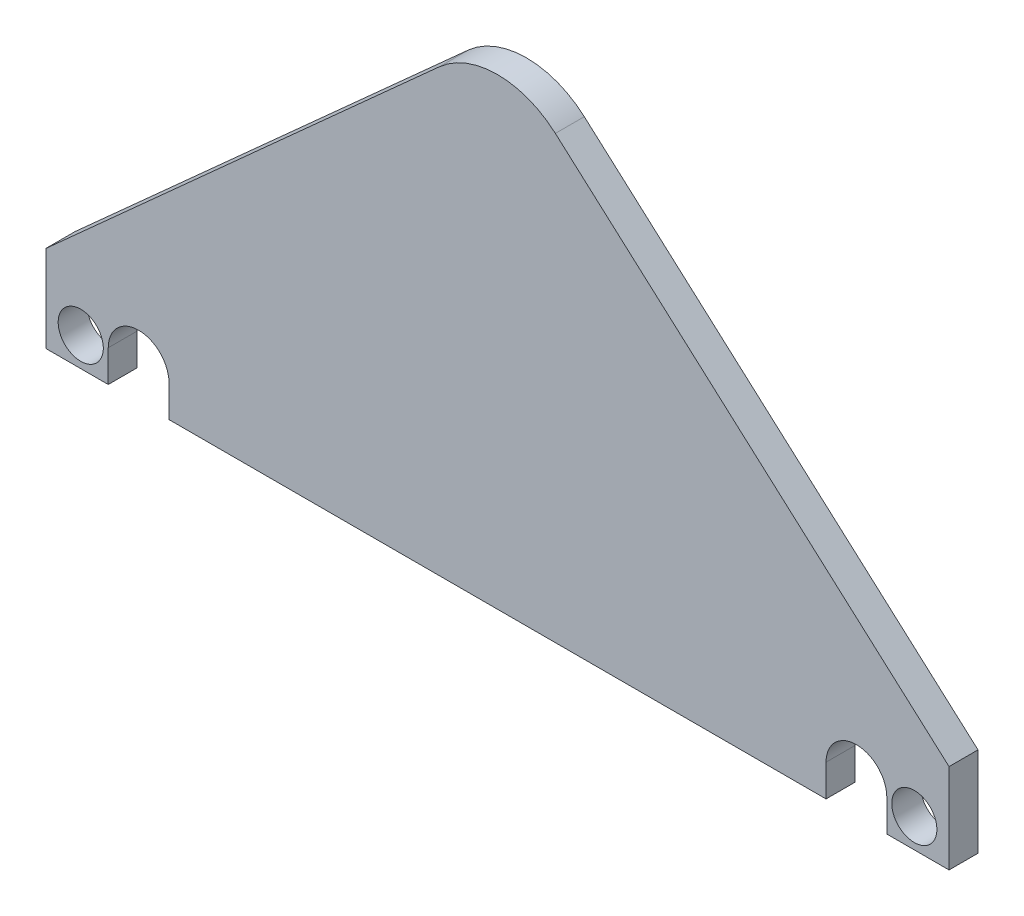
ISO-10303-21;
HEADER;
FILE_DESCRIPTION(('STEP AP214'),'2;1');
FILE_NAME('part.step','',(''),(''),'','','');
FILE_SCHEMA(('AUTOMOTIVE_DESIGN { 1 0 10303 214 1 1 1 1 }'));
ENDSEC;
DATA;
#1=APPLICATION_CONTEXT('core data for automotive mechanical design processes');
#2=APPLICATION_PROTOCOL_DEFINITION('international standard','automotive_design',2000,#1);
#3=PRODUCT_CONTEXT('',#1,'mechanical');
#4=PRODUCT('Part','Part','',(#3));
#5=PRODUCT_RELATED_PRODUCT_CATEGORY('part','',(#4));
#6=PRODUCT_DEFINITION_FORMATION('','',#4);
#7=PRODUCT_DEFINITION_CONTEXT('part definition',#1,'design');
#8=PRODUCT_DEFINITION('design','',#6,#7);
#9=PRODUCT_DEFINITION_SHAPE('','',#8);
#10=(LENGTH_UNIT() NAMED_UNIT(*) SI_UNIT(.MILLI.,.METRE.));
#11=(NAMED_UNIT(*) PLANE_ANGLE_UNIT() SI_UNIT($,.RADIAN.));
#12=(NAMED_UNIT(*) SI_UNIT($,.STERADIAN.) SOLID_ANGLE_UNIT());
#13=UNCERTAINTY_MEASURE_WITH_UNIT(LENGTH_MEASURE(1.E-05),#10,'distance_accuracy_value','');
#14=(GEOMETRIC_REPRESENTATION_CONTEXT(3) GLOBAL_UNCERTAINTY_ASSIGNED_CONTEXT((#13)) GLOBAL_UNIT_ASSIGNED_CONTEXT((#10,
#11,#12)) REPRESENTATION_CONTEXT('',''));
#15=CARTESIAN_POINT('',(0.,0.,0.));
#16=DIRECTION('',(0.,0.,1.));
#17=DIRECTION('',(1.,0.,0.));
#18=AXIS2_PLACEMENT_3D('',#15,#16,#17);
#19=CARTESIAN_POINT('',(0.,82.5,-1130.87615991083));
#20=DIRECTION('',(0.,0.,-1.));
#21=DIRECTION('',(-1.,0.,0.));
#22=AXIS2_PLACEMENT_3D('',#19,#20,#21);
#23=PLANE('',#22);
#24=CARTESIAN_POINT('',(-72.,22.5,-1130.87615991083));
#25=DIRECTION('',(0.,0.,-1.));
#26=DIRECTION('',(-1.,0.,0.));
#27=AXIS2_PLACEMENT_3D('',#24,#25,#26);
#28=CIRCLE('',#27,3.9);
#29=CARTESIAN_POINT('',(-75.9,22.5,-1130.87615991083));
#30=VERTEX_POINT('',#29);
#31=EDGE_CURVE('E170',#30,#30,#28,.T.);
#32=ORIENTED_EDGE('',*,*,#31,.F.);
#33=EDGE_LOOP('',(#32));
#34=FACE_BOUND('',#33,.T.);
#35=DIRECTION('',(-1.,0.,0.));
#36=VECTOR('',#35,1.);
#37=CARTESIAN_POINT('',(-67.25,17.5,-1130.87615991083));
#38=LINE('',#37,#36);
#39=CARTESIAN_POINT('',(-67.25,17.5,-1130.87615991083));
#40=VERTEX_POINT('',#39);
#41=CARTESIAN_POINT('',(-78.,17.5,-1130.87615991083));
#42=VERTEX_POINT('',#41);
#43=EDGE_CURVE('E193',#40,#42,#38,.T.);
#44=ORIENTED_EDGE('',*,*,#43,.T.);
#45=DIRECTION('',(0.,1.,0.));
#46=VECTOR('',#45,1.);
#47=CARTESIAN_POINT('',(-78.,17.5,-1130.87615991083));
#48=LINE('',#47,#46);
#49=CARTESIAN_POINT('',(-78.,32.5,-1130.87615991083));
#50=VERTEX_POINT('',#49);
#51=EDGE_CURVE('E111',#42,#50,#48,.T.);
#52=ORIENTED_EDGE('',*,*,#51,.T.);
#53=DIRECTION('',(0.743400538534937,0.668846499060857,0.));
#54=VECTOR('',#53,1.);
#55=CARTESIAN_POINT('',(-78.,32.5,-1130.87615991083));
#56=LINE('',#55,#54);
#57=CARTESIAN_POINT('',(-10.0326974859129,93.651008078024,-1130.87615991083));
#58=VERTEX_POINT('',#57);
#59=EDGE_CURVE('E226',#50,#58,#56,.T.);
#60=ORIENTED_EDGE('',*,*,#59,.T.);
#61=CARTESIAN_POINT('',(0.,82.5,-1130.87615991083));
#62=DIRECTION('',(0.,0.,-1.));
#63=DIRECTION('',(-1.,0.,0.));
#64=AXIS2_PLACEMENT_3D('',#61,#62,#63);
#65=CIRCLE('',#64,15.);
#66=CARTESIAN_POINT('',(9.98992011578784,93.689347437638,-1130.87615991083));
#67=VERTEX_POINT('',#66);
#68=EDGE_CURVE('E245',#58,#67,#65,.T.);
#69=ORIENTED_EDGE('',*,*,#68,.T.);
#70=DIRECTION('',(0.745956495842538,-0.665994674385856,0.));
#71=VECTOR('',#70,1.);
#72=CARTESIAN_POINT('',(78.,32.9695182520457,-1130.87615991083));
#73=LINE('',#72,#71);
#74=CARTESIAN_POINT('',(78.,32.9695182520457,-1130.87615991083));
#75=VERTEX_POINT('',#74);
#76=EDGE_CURVE('E242',#67,#75,#73,.T.);
#77=ORIENTED_EDGE('',*,*,#76,.T.);
#78=DIRECTION('',(0.,-1.,0.));
#79=VECTOR('',#78,1.);
#80=CARTESIAN_POINT('',(78.,17.5,-1130.87615991083));
#81=LINE('',#80,#79);
#82=CARTESIAN_POINT('',(78.,17.5,-1130.87615991083));
#83=VERTEX_POINT('',#82);
#84=EDGE_CURVE('E244',#75,#83,#81,.T.);
#85=ORIENTED_EDGE('',*,*,#84,.T.);
#86=DIRECTION('',(-1.,0.,0.));
#87=VECTOR('',#86,1.);
#88=CARTESIAN_POINT('',(78.,17.5,-1130.87615991083));
#89=LINE('',#88,#87);
#90=CARTESIAN_POINT('',(67.25,17.5,-1130.87615991083));
#91=VERTEX_POINT('',#90);
#92=EDGE_CURVE('E247',#83,#91,#89,.T.);
#93=ORIENTED_EDGE('',*,*,#92,.T.);
#94=DIRECTION('',(0.,1.,0.));
#95=VECTOR('',#94,1.);
#96=CARTESIAN_POINT('',(67.25,17.5,-1130.87615991083));
#97=LINE('',#96,#95);
#98=CARTESIAN_POINT('',(67.25,23.,-1130.87615991083));
#99=VERTEX_POINT('',#98);
#100=EDGE_CURVE('E253',#91,#99,#97,.T.);
#101=ORIENTED_EDGE('',*,*,#100,.T.);
#102=CARTESIAN_POINT('',(62.,23.,-1130.87615991083));
#103=DIRECTION('',(0.,0.,1.));
#104=DIRECTION('',(1.,0.,0.));
#105=AXIS2_PLACEMENT_3D('',#102,#103,#104);
#106=CIRCLE('',#105,5.25);
#107=CARTESIAN_POINT('',(56.75,23.,-1130.87615991083));
#108=VERTEX_POINT('',#107);
#109=EDGE_CURVE('E255',#99,#108,#106,.T.);
#110=ORIENTED_EDGE('',*,*,#109,.T.);
#111=DIRECTION('',(0.,-1.,0.));
#112=VECTOR('',#111,1.);
#113=CARTESIAN_POINT('',(56.75,23.,-1130.87615991083));
#114=LINE('',#113,#112);
#115=CARTESIAN_POINT('',(56.75,17.5,-1130.87615991083));
#116=VERTEX_POINT('',#115);
#117=EDGE_CURVE('E257',#108,#116,#114,.T.);
#118=ORIENTED_EDGE('',*,*,#117,.T.);
#119=DIRECTION('',(-1.,0.,0.));
#120=VECTOR('',#119,1.);
#121=CARTESIAN_POINT('',(56.75,17.5,-1130.87615991083));
#122=LINE('',#121,#120);
#123=CARTESIAN_POINT('',(-56.75,17.5,-1130.87615991083));
#124=VERTEX_POINT('',#123);
#125=EDGE_CURVE('E148',#116,#124,#122,.T.);
#126=ORIENTED_EDGE('',*,*,#125,.T.);
#127=DIRECTION('',(0.,1.,0.));
#128=VECTOR('',#127,1.);
#129=CARTESIAN_POINT('',(-56.75,23.,-1130.87615991083));
#130=LINE('',#129,#128);
#131=CARTESIAN_POINT('',(-56.75,23.,-1130.87615991083));
#132=VERTEX_POINT('',#131);
#133=EDGE_CURVE('E142',#124,#132,#130,.T.);
#134=ORIENTED_EDGE('',*,*,#133,.T.);
#135=CARTESIAN_POINT('',(-62.,23.,-1130.87615991083));
#136=DIRECTION('',(0.,0.,1.));
#137=DIRECTION('',(-1.,0.,0.));
#138=AXIS2_PLACEMENT_3D('',#135,#136,#137);
#139=CIRCLE('',#138,5.25);
#140=CARTESIAN_POINT('',(-67.25,23.,-1130.87615991083));
#141=VERTEX_POINT('',#140);
#142=EDGE_CURVE('E146',#132,#141,#139,.T.);
#143=ORIENTED_EDGE('',*,*,#142,.T.);
#144=DIRECTION('',(0.,-1.,0.));
#145=VECTOR('',#144,1.);
#146=CARTESIAN_POINT('',(-67.25,17.5,-1130.87615991083));
#147=LINE('',#146,#145);
#148=EDGE_CURVE('E50',#141,#40,#147,.T.);
#149=ORIENTED_EDGE('',*,*,#148,.T.);
#150=EDGE_LOOP('',(#44,#52,#60,#69,#77,#85,#93,#101,#110,#118,#126,#134,#143,#149));
#151=FACE_BOUND('',#150,.T.);
#152=CARTESIAN_POINT('',(72.,22.5,-1130.87615991083));
#153=DIRECTION('',(0.,0.,-1.));
#154=DIRECTION('',(-1.,0.,0.));
#155=AXIS2_PLACEMENT_3D('',#152,#153,#154);
#156=CIRCLE('',#155,3.9);
#157=CARTESIAN_POINT('',(68.1,22.5,-1130.87615991083));
#158=VERTEX_POINT('',#157);
#159=EDGE_CURVE('E299',#158,#158,#156,.T.);
#160=ORIENTED_EDGE('',*,*,#159,.F.);
#161=EDGE_LOOP('',(#160));
#162=FACE_BOUND('',#161,.T.);
#163=ADVANCED_FACE('F33',(#34,#151,#162),#23,.T.);
#164=CARTESIAN_POINT('',(0.,82.5,-1125.87615991083));
#165=DIRECTION('',(0.,0.,-1.));
#166=DIRECTION('',(-1.,0.,0.));
#167=AXIS2_PLACEMENT_3D('',#164,#165,#166);
#168=PLANE('',#167);
#169=DIRECTION('',(-1.,0.,0.));
#170=VECTOR('',#169,1.);
#171=CARTESIAN_POINT('',(-67.25,17.5,-1125.87615991083));
#172=LINE('',#171,#170);
#173=CARTESIAN_POINT('',(-67.25,17.5,-1125.87615991083));
#174=VERTEX_POINT('',#173);
#175=CARTESIAN_POINT('',(-78.,17.5,-1125.87615991083));
#176=VERTEX_POINT('',#175);
#177=EDGE_CURVE('E166',#174,#176,#172,.T.);
#178=ORIENTED_EDGE('',*,*,#177,.F.);
#179=DIRECTION('',(0.,-1.,0.));
#180=VECTOR('',#179,1.);
#181=CARTESIAN_POINT('',(-67.25,17.5,-1125.87615991083));
#182=LINE('',#181,#180);
#183=CARTESIAN_POINT('',(-67.25,23.,-1125.87615991083));
#184=VERTEX_POINT('',#183);
#185=EDGE_CURVE('E103',#184,#174,#182,.T.);
#186=ORIENTED_EDGE('',*,*,#185,.F.);
#187=CARTESIAN_POINT('',(-62.,23.,-1125.87615991083));
#188=DIRECTION('',(0.,0.,1.));
#189=DIRECTION('',(-1.,0.,0.));
#190=AXIS2_PLACEMENT_3D('',#187,#188,#189);
#191=CIRCLE('',#190,5.25);
#192=CARTESIAN_POINT('',(-56.75,23.,-1125.87615991083));
#193=VERTEX_POINT('',#192);
#194=EDGE_CURVE('E97',#193,#184,#191,.T.);
#195=ORIENTED_EDGE('',*,*,#194,.F.);
#196=DIRECTION('',(0.,1.,0.));
#197=VECTOR('',#196,1.);
#198=CARTESIAN_POINT('',(-56.75,23.,-1125.87615991083));
#199=LINE('',#198,#197);
#200=CARTESIAN_POINT('',(-56.75,17.5,-1125.87615991083));
#201=VERTEX_POINT('',#200);
#202=EDGE_CURVE('E156',#201,#193,#199,.T.);
#203=ORIENTED_EDGE('',*,*,#202,.F.);
#204=DIRECTION('',(-1.,0.,0.));
#205=VECTOR('',#204,1.);
#206=CARTESIAN_POINT('',(56.75,17.5,-1125.87615991083));
#207=LINE('',#206,#205);
#208=CARTESIAN_POINT('',(56.75,17.5,-1125.87615991083));
#209=VERTEX_POINT('',#208);
#210=EDGE_CURVE('E188',#209,#201,#207,.T.);
#211=ORIENTED_EDGE('',*,*,#210,.F.);
#212=DIRECTION('',(0.,-1.,0.));
#213=VECTOR('',#212,1.);
#214=CARTESIAN_POINT('',(56.75,23.,-1125.87615991083));
#215=LINE('',#214,#213);
#216=CARTESIAN_POINT('',(56.75,23.,-1125.87615991083));
#217=VERTEX_POINT('',#216);
#218=EDGE_CURVE('E186',#217,#209,#215,.T.);
#219=ORIENTED_EDGE('',*,*,#218,.F.);
#220=CARTESIAN_POINT('',(62.,23.,-1125.87615991083));
#221=DIRECTION('',(0.,0.,1.));
#222=DIRECTION('',(1.,0.,0.));
#223=AXIS2_PLACEMENT_3D('',#220,#221,#222);
#224=CIRCLE('',#223,5.25);
#225=CARTESIAN_POINT('',(67.25,23.,-1125.87615991083));
#226=VERTEX_POINT('',#225);
#227=EDGE_CURVE('E184',#226,#217,#224,.T.);
#228=ORIENTED_EDGE('',*,*,#227,.F.);
#229=DIRECTION('',(0.,1.,0.));
#230=VECTOR('',#229,1.);
#231=CARTESIAN_POINT('',(67.25,17.5,-1125.87615991083));
#232=LINE('',#231,#230);
#233=CARTESIAN_POINT('',(67.25,17.5,-1125.87615991083));
#234=VERTEX_POINT('',#233);
#235=EDGE_CURVE('E182',#234,#226,#232,.T.);
#236=ORIENTED_EDGE('',*,*,#235,.F.);
#237=DIRECTION('',(-1.,0.,0.));
#238=VECTOR('',#237,1.);
#239=CARTESIAN_POINT('',(78.,17.5,-1125.87615991083));
#240=LINE('',#239,#238);
#241=CARTESIAN_POINT('',(78.,17.5,-1125.87615991083));
#242=VERTEX_POINT('',#241);
#243=EDGE_CURVE('E180',#242,#234,#240,.T.);
#244=ORIENTED_EDGE('',*,*,#243,.F.);
#245=DIRECTION('',(0.,-1.,0.));
#246=VECTOR('',#245,1.);
#247=CARTESIAN_POINT('',(78.,17.5,-1125.87615991083));
#248=LINE('',#247,#246);
#249=CARTESIAN_POINT('',(78.,32.9695182520457,-1125.87615991083));
#250=VERTEX_POINT('',#249);
#251=EDGE_CURVE('E178',#250,#242,#248,.T.);
#252=ORIENTED_EDGE('',*,*,#251,.F.);
#253=DIRECTION('',(0.745956495842538,-0.665994674385856,0.));
#254=VECTOR('',#253,1.);
#255=CARTESIAN_POINT('',(78.,32.9695182520457,-1125.87615991083));
#256=LINE('',#255,#254);
#257=CARTESIAN_POINT('',(9.98992011578784,93.689347437638,-1125.87615991083));
#258=VERTEX_POINT('',#257);
#259=EDGE_CURVE('E176',#258,#250,#256,.T.);
#260=ORIENTED_EDGE('',*,*,#259,.F.);
#261=CARTESIAN_POINT('',(0.,82.5,-1125.87615991083));
#262=DIRECTION('',(0.,0.,-1.));
#263=DIRECTION('',(-1.,0.,0.));
#264=AXIS2_PLACEMENT_3D('',#261,#262,#263);
#265=CIRCLE('',#264,15.);
#266=CARTESIAN_POINT('',(-10.0326974859129,93.651008078024,-1125.87615991083));
#267=VERTEX_POINT('',#266);
#268=EDGE_CURVE('E174',#267,#258,#265,.T.);
#269=ORIENTED_EDGE('',*,*,#268,.F.);
#270=DIRECTION('',(0.743400538534937,0.668846499060857,0.));
#271=VECTOR('',#270,1.);
#272=CARTESIAN_POINT('',(-78.,32.5,-1125.87615991083));
#273=LINE('',#272,#271);
#274=CARTESIAN_POINT('',(-78.,32.5,-1125.87615991083));
#275=VERTEX_POINT('',#274);
#276=EDGE_CURVE('E172',#275,#267,#273,.T.);
#277=ORIENTED_EDGE('',*,*,#276,.F.);
#278=DIRECTION('',(0.,1.,0.));
#279=VECTOR('',#278,1.);
#280=CARTESIAN_POINT('',(-78.,17.5,-1125.87615991083));
#281=LINE('',#280,#279);
#282=EDGE_CURVE('E169',#176,#275,#281,.T.);
#283=ORIENTED_EDGE('',*,*,#282,.F.);
#284=EDGE_LOOP('',(#178,#186,#195,#203,#211,#219,#228,#236,#244,#252,#260,#269,#277,#283));
#285=FACE_BOUND('',#284,.T.);
#286=CARTESIAN_POINT('',(-72.,22.5,-1125.87615991083));
#287=DIRECTION('',(0.,0.,-1.));
#288=DIRECTION('',(-1.,0.,0.));
#289=AXIS2_PLACEMENT_3D('',#286,#287,#288);
#290=CIRCLE('',#289,3.9);
#291=CARTESIAN_POINT('',(-75.9,22.5,-1125.87615991083));
#292=VERTEX_POINT('',#291);
#293=EDGE_CURVE('E305',#292,#292,#290,.T.);
#294=ORIENTED_EDGE('',*,*,#293,.T.);
#295=EDGE_LOOP('',(#294));
#296=FACE_BOUND('',#295,.T.);
#297=CARTESIAN_POINT('',(72.,22.5,-1125.87615991083));
#298=DIRECTION('',(0.,0.,-1.));
#299=DIRECTION('',(-1.,0.,0.));
#300=AXIS2_PLACEMENT_3D('',#297,#298,#299);
#301=CIRCLE('',#300,3.9);
#302=CARTESIAN_POINT('',(68.1,22.5,-1125.87615991083));
#303=VERTEX_POINT('',#302);
#304=EDGE_CURVE('E302',#303,#303,#301,.T.);
#305=ORIENTED_EDGE('',*,*,#304,.T.);
#306=EDGE_LOOP('',(#305));
#307=FACE_BOUND('',#306,.T.);
#308=ADVANCED_FACE('F230',(#285,#296,#307),#168,.F.);
#309=CARTESIAN_POINT('',(-67.25,17.5,-1130.87615991083));
#310=DIRECTION('',(0.,1.,0.));
#311=DIRECTION('',(0.,0.,1.));
#312=AXIS2_PLACEMENT_3D('',#309,#310,#311);
#313=PLANE('',#312);
#314=ORIENTED_EDGE('',*,*,#177,.T.);
#315=DIRECTION('',(0.,0.,1.));
#316=VECTOR('',#315,1.);
#317=CARTESIAN_POINT('',(-78.,17.5,-1130.87615991083));
#318=LINE('',#317,#316);
#319=EDGE_CURVE('E11',#42,#176,#318,.T.);
#320=ORIENTED_EDGE('',*,*,#319,.F.);
#321=ORIENTED_EDGE('',*,*,#43,.F.);
#322=DIRECTION('',(0.,0.,1.));
#323=VECTOR('',#322,1.);
#324=CARTESIAN_POINT('',(-67.25,17.5,-1130.87615991083));
#325=LINE('',#324,#323);
#326=EDGE_CURVE('E162',#40,#174,#325,.T.);
#327=ORIENTED_EDGE('',*,*,#326,.T.);
#328=EDGE_LOOP('',(#314,#320,#321,#327));
#329=FACE_BOUND('',#328,.T.);
#330=ADVANCED_FACE('F35',(#329),#313,.F.);
#331=CARTESIAN_POINT('',(-78.,17.5,-1130.87615991083));
#332=DIRECTION('',(1.,0.,0.));
#333=DIRECTION('',(0.,0.,-1.));
#334=AXIS2_PLACEMENT_3D('',#331,#332,#333);
#335=PLANE('',#334);
#336=ORIENTED_EDGE('',*,*,#282,.T.);
#337=DIRECTION('',(0.,0.,1.));
#338=VECTOR('',#337,1.);
#339=CARTESIAN_POINT('',(-78.,32.5,-1130.87615991083));
#340=LINE('',#339,#338);
#341=EDGE_CURVE('E42',#50,#275,#340,.T.);
#342=ORIENTED_EDGE('',*,*,#341,.F.);
#343=ORIENTED_EDGE('',*,*,#51,.F.);
#344=ORIENTED_EDGE('',*,*,#319,.T.);
#345=EDGE_LOOP('',(#336,#342,#343,#344));
#346=FACE_BOUND('',#345,.T.);
#347=ADVANCED_FACE('F418',(#346),#335,.F.);
#348=CARTESIAN_POINT('',(-78.,32.5,-1130.87615991083));
#349=DIRECTION('',(0.668846499060857,-0.743400538534937,0.));
#350=DIRECTION('',(0.743400538534937,0.668846499060857,0.));
#351=AXIS2_PLACEMENT_3D('',#348,#349,#350);
#352=PLANE('',#351);
#353=ORIENTED_EDGE('',*,*,#276,.T.);
#354=DIRECTION('',(0.,0.,1.));
#355=VECTOR('',#354,1.);
#356=CARTESIAN_POINT('',(-10.0326974859129,93.651008078024,-1130.87615991083));
#357=LINE('',#356,#355);
#358=EDGE_CURVE('E218',#58,#267,#357,.T.);
#359=ORIENTED_EDGE('',*,*,#358,.F.);
#360=ORIENTED_EDGE('',*,*,#59,.F.);
#361=ORIENTED_EDGE('',*,*,#341,.T.);
#362=EDGE_LOOP('',(#353,#359,#360,#361));
#363=FACE_BOUND('',#362,.T.);
#364=ADVANCED_FACE('F224',(#363),#352,.F.);
#365=CARTESIAN_POINT('',(0.,82.5,-1130.87615991083));
#366=DIRECTION('',(0.,0.,1.));
#367=DIRECTION('',(1.,0.,0.));
#368=AXIS2_PLACEMENT_3D('',#365,#366,#367);
#369=CYLINDRICAL_SURFACE('',#368,15.);
#370=ORIENTED_EDGE('',*,*,#268,.T.);
#371=DIRECTION('',(0.,0.,1.));
#372=VECTOR('',#371,1.);
#373=CARTESIAN_POINT('',(9.98992011578784,93.689347437638,-1130.87615991083));
#374=LINE('',#373,#372);
#375=EDGE_CURVE('E215',#67,#258,#374,.T.);
#376=ORIENTED_EDGE('',*,*,#375,.F.);
#377=ORIENTED_EDGE('',*,*,#68,.F.);
#378=ORIENTED_EDGE('',*,*,#358,.T.);
#379=EDGE_LOOP('',(#370,#376,#377,#378));
#380=FACE_BOUND('',#379,.T.);
#381=ADVANCED_FACE('F236',(#380),#369,.T.);
#382=CARTESIAN_POINT('',(78.,32.9695182520457,-1130.87615991083));
#383=DIRECTION('',(-0.665994674385856,-0.745956495842538,0.));
#384=DIRECTION('',(0.745956495842538,-0.665994674385856,0.));
#385=AXIS2_PLACEMENT_3D('',#382,#383,#384);
#386=PLANE('',#385);
#387=ORIENTED_EDGE('',*,*,#259,.T.);
#388=DIRECTION('',(0.,0.,1.));
#389=VECTOR('',#388,1.);
#390=CARTESIAN_POINT('',(78.,32.9695182520457,-1130.87615991083));
#391=LINE('',#390,#389);
#392=EDGE_CURVE('E212',#75,#250,#391,.T.);
#393=ORIENTED_EDGE('',*,*,#392,.F.);
#394=ORIENTED_EDGE('',*,*,#76,.F.);
#395=ORIENTED_EDGE('',*,*,#375,.T.);
#396=EDGE_LOOP('',(#387,#393,#394,#395));
#397=FACE_BOUND('',#396,.T.);
#398=ADVANCED_FACE('F240',(#397),#386,.F.);
#399=CARTESIAN_POINT('',(78.,17.5,-1130.87615991083));
#400=DIRECTION('',(-1.,0.,0.));
#401=DIRECTION('',(0.,0.,1.));
#402=AXIS2_PLACEMENT_3D('',#399,#400,#401);
#403=PLANE('',#402);
#404=ORIENTED_EDGE('',*,*,#251,.T.);
#405=DIRECTION('',(0.,0.,1.));
#406=VECTOR('',#405,1.);
#407=CARTESIAN_POINT('',(78.,17.5,-1130.87615991083));
#408=LINE('',#407,#406);
#409=EDGE_CURVE('E209',#83,#242,#408,.T.);
#410=ORIENTED_EDGE('',*,*,#409,.F.);
#411=ORIENTED_EDGE('',*,*,#84,.F.);
#412=ORIENTED_EDGE('',*,*,#392,.T.);
#413=EDGE_LOOP('',(#404,#410,#411,#412));
#414=FACE_BOUND('',#413,.T.);
#415=ADVANCED_FACE('F383',(#414),#403,.F.);
#416=CARTESIAN_POINT('',(78.,17.5,-1130.87615991083));
#417=DIRECTION('',(0.,1.,0.));
#418=DIRECTION('',(0.,0.,1.));
#419=AXIS2_PLACEMENT_3D('',#416,#417,#418);
#420=PLANE('',#419);
#421=ORIENTED_EDGE('',*,*,#243,.T.);
#422=DIRECTION('',(0.,0.,1.));
#423=VECTOR('',#422,1.);
#424=CARTESIAN_POINT('',(67.25,17.5,-1130.87615991083));
#425=LINE('',#424,#423);
#426=EDGE_CURVE('E206',#91,#234,#425,.T.);
#427=ORIENTED_EDGE('',*,*,#426,.F.);
#428=ORIENTED_EDGE('',*,*,#92,.F.);
#429=ORIENTED_EDGE('',*,*,#409,.T.);
#430=EDGE_LOOP('',(#421,#427,#428,#429));
#431=FACE_BOUND('',#430,.T.);
#432=ADVANCED_FACE('F373',(#431),#420,.F.);
#433=CARTESIAN_POINT('',(67.25,17.5,-1130.87615991083));
#434=DIRECTION('',(1.,0.,0.));
#435=DIRECTION('',(0.,0.,-1.));
#436=AXIS2_PLACEMENT_3D('',#433,#434,#435);
#437=PLANE('',#436);
#438=ORIENTED_EDGE('',*,*,#235,.T.);
#439=DIRECTION('',(0.,0.,1.));
#440=VECTOR('',#439,1.);
#441=CARTESIAN_POINT('',(67.25,23.,-1130.87615991083));
#442=LINE('',#441,#440);
#443=EDGE_CURVE('E203',#99,#226,#442,.T.);
#444=ORIENTED_EDGE('',*,*,#443,.F.);
#445=ORIENTED_EDGE('',*,*,#100,.F.);
#446=ORIENTED_EDGE('',*,*,#426,.T.);
#447=EDGE_LOOP('',(#438,#444,#445,#446));
#448=FACE_BOUND('',#447,.T.);
#449=ADVANCED_FACE('F363',(#448),#437,.F.);
#450=CARTESIAN_POINT('',(62.,23.,-1130.87615991083));
#451=DIRECTION('',(0.,0.,1.));
#452=DIRECTION('',(1.,0.,0.));
#453=AXIS2_PLACEMENT_3D('',#450,#451,#452);
#454=CYLINDRICAL_SURFACE('',#453,5.25);
#455=ORIENTED_EDGE('',*,*,#227,.T.);
#456=DIRECTION('',(0.,0.,1.));
#457=VECTOR('',#456,1.);
#458=CARTESIAN_POINT('',(56.75,23.,-1130.87615991083));
#459=LINE('',#458,#457);
#460=EDGE_CURVE('E200',#108,#217,#459,.T.);
#461=ORIENTED_EDGE('',*,*,#460,.F.);
#462=ORIENTED_EDGE('',*,*,#109,.F.);
#463=ORIENTED_EDGE('',*,*,#443,.T.);
#464=EDGE_LOOP('',(#455,#461,#462,#463));
#465=FACE_BOUND('',#464,.T.);
#466=ADVANCED_FACE('F354',(#465),#454,.F.);
#467=CARTESIAN_POINT('',(56.75,23.,-1130.87615991083));
#468=DIRECTION('',(-1.,0.,0.));
#469=DIRECTION('',(0.,-1.,0.));
#470=AXIS2_PLACEMENT_3D('',#467,#468,#469);
#471=PLANE('',#470);
#472=ORIENTED_EDGE('',*,*,#218,.T.);
#473=DIRECTION('',(0.,0.,1.));
#474=VECTOR('',#473,1.);
#475=CARTESIAN_POINT('',(56.75,17.5,-1130.87615991083));
#476=LINE('',#475,#474);
#477=EDGE_CURVE('E197',#116,#209,#476,.T.);
#478=ORIENTED_EDGE('',*,*,#477,.F.);
#479=ORIENTED_EDGE('',*,*,#117,.F.);
#480=ORIENTED_EDGE('',*,*,#460,.T.);
#481=EDGE_LOOP('',(#472,#478,#479,#480));
#482=FACE_BOUND('',#481,.T.);
#483=ADVANCED_FACE('F263',(#482),#471,.F.);
#484=CARTESIAN_POINT('',(56.75,17.5,-1130.87615991083));
#485=DIRECTION('',(0.,1.,0.));
#486=DIRECTION('',(0.,0.,1.));
#487=AXIS2_PLACEMENT_3D('',#484,#485,#486);
#488=PLANE('',#487);
#489=ORIENTED_EDGE('',*,*,#210,.T.);
#490=DIRECTION('',(0.,0.,1.));
#491=VECTOR('',#490,1.);
#492=CARTESIAN_POINT('',(-56.75,17.5,-1130.87615991083));
#493=LINE('',#492,#491);
#494=EDGE_CURVE('E157',#124,#201,#493,.T.);
#495=ORIENTED_EDGE('',*,*,#494,.F.);
#496=ORIENTED_EDGE('',*,*,#125,.F.);
#497=ORIENTED_EDGE('',*,*,#477,.T.);
#498=EDGE_LOOP('',(#489,#495,#496,#497));
#499=FACE_BOUND('',#498,.T.);
#500=ADVANCED_FACE('F267',(#499),#488,.F.);
#501=CARTESIAN_POINT('',(-56.75,23.,-1130.87615991083));
#502=DIRECTION('',(1.,0.,0.));
#503=DIRECTION('',(0.,0.,-1.));
#504=AXIS2_PLACEMENT_3D('',#501,#502,#503);
#505=PLANE('',#504);
#506=ORIENTED_EDGE('',*,*,#202,.T.);
#507=DIRECTION('',(0.,0.,1.));
#508=VECTOR('',#507,1.);
#509=CARTESIAN_POINT('',(-56.75,23.,-1130.87615991083));
#510=LINE('',#509,#508);
#511=EDGE_CURVE('E153',#132,#193,#510,.T.);
#512=ORIENTED_EDGE('',*,*,#511,.F.);
#513=ORIENTED_EDGE('',*,*,#133,.F.);
#514=ORIENTED_EDGE('',*,*,#494,.T.);
#515=EDGE_LOOP('',(#506,#512,#513,#514));
#516=FACE_BOUND('',#515,.T.);
#517=ADVANCED_FACE('F154',(#516),#505,.F.);
#518=CARTESIAN_POINT('',(-62.,23.,-1130.87615991083));
#519=DIRECTION('',(0.,0.,1.));
#520=DIRECTION('',(1.,0.,0.));
#521=AXIS2_PLACEMENT_3D('',#518,#519,#520);
#522=CYLINDRICAL_SURFACE('',#521,5.25);
#523=ORIENTED_EDGE('',*,*,#194,.T.);
#524=DIRECTION('',(0.,0.,1.));
#525=VECTOR('',#524,1.);
#526=CARTESIAN_POINT('',(-67.25,23.,-1130.87615991083));
#527=LINE('',#526,#525);
#528=EDGE_CURVE('E158',#141,#184,#527,.T.);
#529=ORIENTED_EDGE('',*,*,#528,.F.);
#530=ORIENTED_EDGE('',*,*,#142,.F.);
#531=ORIENTED_EDGE('',*,*,#511,.T.);
#532=EDGE_LOOP('',(#523,#529,#530,#531));
#533=FACE_BOUND('',#532,.T.);
#534=ADVANCED_FACE('F160',(#533),#522,.F.);
#535=CARTESIAN_POINT('',(-67.25,17.5,-1130.87615991083));
#536=DIRECTION('',(-1.,0.,0.));
#537=DIRECTION('',(0.,0.,1.));
#538=AXIS2_PLACEMENT_3D('',#535,#536,#537);
#539=PLANE('',#538);
#540=ORIENTED_EDGE('',*,*,#185,.T.);
#541=ORIENTED_EDGE('',*,*,#326,.F.);
#542=ORIENTED_EDGE('',*,*,#148,.F.);
#543=ORIENTED_EDGE('',*,*,#528,.T.);
#544=EDGE_LOOP('',(#540,#541,#542,#543));
#545=FACE_BOUND('',#544,.T.);
#546=ADVANCED_FACE('F271',(#545),#539,.F.);
#547=CARTESIAN_POINT('',(-72.,22.5,-1130.87615991083));
#548=DIRECTION('',(0.,0.,1.));
#549=DIRECTION('',(1.,0.,0.));
#550=AXIS2_PLACEMENT_3D('',#547,#548,#549);
#551=CYLINDRICAL_SURFACE('',#550,3.9);
#552=ORIENTED_EDGE('',*,*,#31,.T.);
#553=EDGE_LOOP('',(#552));
#554=FACE_BOUND('',#553,.T.);
#555=ORIENTED_EDGE('',*,*,#293,.F.);
#556=EDGE_LOOP('',(#555));
#557=FACE_BOUND('',#556,.T.);
#558=ADVANCED_FACE('F273',(#554,#557),#551,.F.);
#559=CARTESIAN_POINT('',(72.,22.5,-1130.87615991083));
#560=DIRECTION('',(0.,0.,1.));
#561=DIRECTION('',(1.,0.,0.));
#562=AXIS2_PLACEMENT_3D('',#559,#560,#561);
#563=CYLINDRICAL_SURFACE('',#562,3.9);
#564=ORIENTED_EDGE('',*,*,#159,.T.);
#565=EDGE_LOOP('',(#564));
#566=FACE_BOUND('',#565,.T.);
#567=ORIENTED_EDGE('',*,*,#304,.F.);
#568=EDGE_LOOP('',(#567));
#569=FACE_BOUND('',#568,.T.);
#570=ADVANCED_FACE('F279',(#566,#569),#563,.F.);
#571=CLOSED_SHELL('',(#163,#308,#330,#347,#364,#381,#398,#415,#432,#449,#466,#483,#500,#517,
#534,#546,#558,#570));
#572=MANIFOLD_SOLID_BREP('B2',#571);
#573=ADVANCED_BREP_SHAPE_REPRESENTATION('',(#18,#572),#14);
#574=SHAPE_DEFINITION_REPRESENTATION(#9,#573);
ENDSEC;
END-ISO-10303-21;
